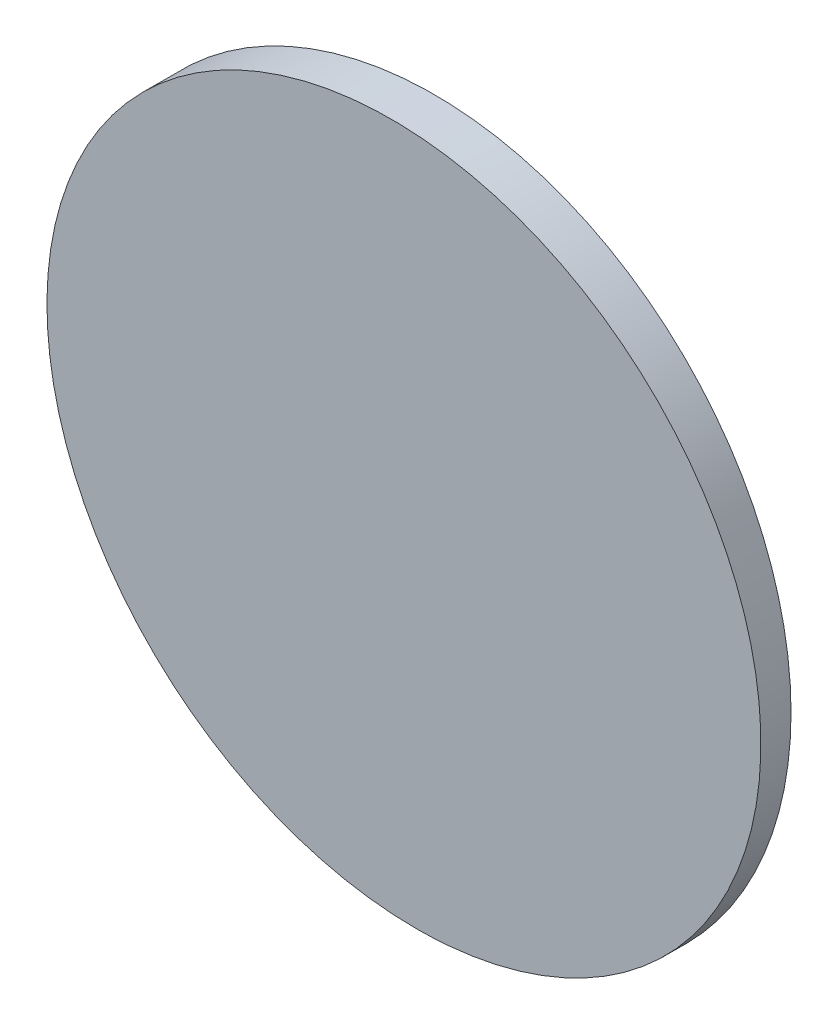
ISO-10303-21;
HEADER;
FILE_DESCRIPTION(('STEP AP214'),'2;1');
FILE_NAME('part.step','',(''),(''),'','','');
FILE_SCHEMA(('AUTOMOTIVE_DESIGN { 1 0 10303 214 1 1 1 1 }'));
ENDSEC;
DATA;
#1=APPLICATION_CONTEXT('core data for automotive mechanical design processes');
#2=APPLICATION_PROTOCOL_DEFINITION('international standard','automotive_design',2000,#1);
#3=PRODUCT_CONTEXT('',#1,'mechanical');
#4=PRODUCT('Part','Part','',(#3));
#5=PRODUCT_RELATED_PRODUCT_CATEGORY('part','',(#4));
#6=PRODUCT_DEFINITION_FORMATION('','',#4);
#7=PRODUCT_DEFINITION_CONTEXT('part definition',#1,'design');
#8=PRODUCT_DEFINITION('design','',#6,#7);
#9=PRODUCT_DEFINITION_SHAPE('','',#8);
#10=(LENGTH_UNIT() NAMED_UNIT(*) SI_UNIT(.MILLI.,.METRE.));
#11=(NAMED_UNIT(*) PLANE_ANGLE_UNIT() SI_UNIT($,.RADIAN.));
#12=(NAMED_UNIT(*) SI_UNIT($,.STERADIAN.) SOLID_ANGLE_UNIT());
#13=UNCERTAINTY_MEASURE_WITH_UNIT(LENGTH_MEASURE(1.E-05),#10,'distance_accuracy_value','');
#14=(GEOMETRIC_REPRESENTATION_CONTEXT(3) GLOBAL_UNCERTAINTY_ASSIGNED_CONTEXT((#13)) GLOBAL_UNIT_ASSIGNED_CONTEXT((#10,
#11,#12)) REPRESENTATION_CONTEXT('',''));
#15=CARTESIAN_POINT('',(0.,0.,0.));
#16=DIRECTION('',(0.,0.,1.));
#17=DIRECTION('',(1.,0.,0.));
#18=AXIS2_PLACEMENT_3D('',#15,#16,#17);
#19=CARTESIAN_POINT('',(0.,0.,6.));
#20=DIRECTION('',(0.,0.,-1.));
#21=DIRECTION('',(-1.,0.,0.));
#22=AXIS2_PLACEMENT_3D('',#19,#20,#21);
#23=CYLINDRICAL_SURFACE('',#22,50.);
#24=CARTESIAN_POINT('',(0.,0.,0.));
#25=DIRECTION('',(0.,0.,1.));
#26=DIRECTION('',(1.,0.,0.));
#27=AXIS2_PLACEMENT_3D('',#24,#25,#26);
#28=CIRCLE('',#27,50.);
#29=CARTESIAN_POINT('',(50.,0.,0.));
#30=VERTEX_POINT('',#29);
#31=EDGE_CURVE('E10',#30,#30,#28,.T.);
#32=ORIENTED_EDGE('',*,*,#31,.T.);
#33=EDGE_LOOP('',(#32));
#34=FACE_BOUND('',#33,.T.);
#35=CARTESIAN_POINT('',(0.,0.,4.25396152541296));
#36=DIRECTION('',(0.,0.034899496702494,-0.999390827019096));
#37=DIRECTION('',(0.,-0.999390827019096,-0.034899496702494));
#38=AXIS2_PLACEMENT_3D('',#35,#36,#37);
#39=ELLIPSE('',#38,50.0304772149411,50.);
#40=CARTESIAN_POINT('',(0.,-50.,2.50792305082592));
#41=VERTEX_POINT('',#40);
#42=EDGE_CURVE('E39',#41,#41,#39,.T.);
#43=ORIENTED_EDGE('',*,*,#42,.T.);
#44=EDGE_LOOP('',(#43));
#45=FACE_BOUND('',#44,.T.);
#46=ADVANCED_FACE('F33',(#34,#45),#23,.T.);
#47=CARTESIAN_POINT('',(0.,0.,0.));
#48=DIRECTION('',(0.,0.,1.));
#49=DIRECTION('',(1.,0.,0.));
#50=AXIS2_PLACEMENT_3D('',#47,#48,#49);
#51=PLANE('',#50);
#52=ORIENTED_EDGE('',*,*,#31,.F.);
#53=EDGE_LOOP('',(#52));
#54=FACE_BOUND('',#53,.T.);
#55=ADVANCED_FACE('F48',(#54),#51,.F.);
#56=CARTESIAN_POINT('',(-50.,50.,6.));
#57=DIRECTION('',(0.,0.034899496702494,-0.999390827019096));
#58=DIRECTION('',(0.,0.999390827019096,0.034899496702494));
#59=AXIS2_PLACEMENT_3D('',#56,#57,#58);
#60=PLANE('',#59);
#61=ORIENTED_EDGE('',*,*,#42,.F.);
#62=EDGE_LOOP('',(#61));
#63=FACE_BOUND('',#62,.T.);
#64=ADVANCED_FACE('F46',(#63),#60,.F.);
#65=CLOSED_SHELL('',(#46,#55,#64));
#66=MANIFOLD_SOLID_BREP('B2',#65);
#67=ADVANCED_BREP_SHAPE_REPRESENTATION('',(#18,#66),#14);
#68=SHAPE_DEFINITION_REPRESENTATION(#9,#67);
ENDSEC;
END-ISO-10303-21;
